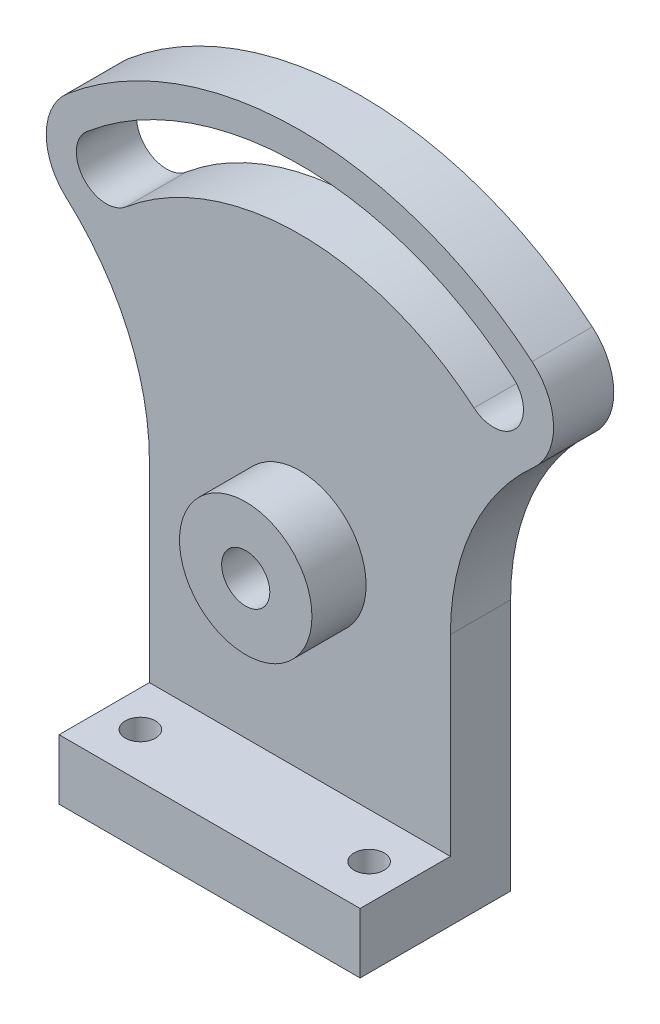
ISO-10303-21;
HEADER;
FILE_DESCRIPTION(('STEP AP214'),'2;1');
FILE_NAME('part.step','',(''),(''),'','','');
FILE_SCHEMA(('AUTOMOTIVE_DESIGN { 1 0 10303 214 1 1 1 1 }'));
ENDSEC;
DATA;
#1=APPLICATION_CONTEXT('core data for automotive mechanical design processes');
#2=APPLICATION_PROTOCOL_DEFINITION('international standard','automotive_design',2000,#1);
#3=PRODUCT_CONTEXT('',#1,'mechanical');
#4=PRODUCT('Part','Part','',(#3));
#5=PRODUCT_RELATED_PRODUCT_CATEGORY('part','',(#4));
#6=PRODUCT_DEFINITION_FORMATION('','',#4);
#7=PRODUCT_DEFINITION_CONTEXT('part definition',#1,'design');
#8=PRODUCT_DEFINITION('design','',#6,#7);
#9=PRODUCT_DEFINITION_SHAPE('','',#8);
#10=(LENGTH_UNIT() NAMED_UNIT(*) SI_UNIT(.MILLI.,.METRE.));
#11=(NAMED_UNIT(*) PLANE_ANGLE_UNIT() SI_UNIT($,.RADIAN.));
#12=(NAMED_UNIT(*) SI_UNIT($,.STERADIAN.) SOLID_ANGLE_UNIT());
#13=UNCERTAINTY_MEASURE_WITH_UNIT(LENGTH_MEASURE(1.E-05),#10,'distance_accuracy_value','');
#14=(GEOMETRIC_REPRESENTATION_CONTEXT(3) GLOBAL_UNCERTAINTY_ASSIGNED_CONTEXT((#13)) GLOBAL_UNIT_ASSIGNED_CONTEXT((#10,
#11,#12)) REPRESENTATION_CONTEXT('',''));
#15=CARTESIAN_POINT('',(0.,0.,0.));
#16=DIRECTION('',(0.,0.,1.));
#17=DIRECTION('',(1.,0.,0.));
#18=AXIS2_PLACEMENT_3D('',#15,#16,#17);
#19=CARTESIAN_POINT('',(-66.5842002615122,41.9032103569842,10.));
#20=DIRECTION('',(0.,0.,1.));
#21=DIRECTION('',(1.,0.,0.));
#22=AXIS2_PLACEMENT_3D('',#19,#20,#21);
#23=PLANE('',#22);
#24=CARTESIAN_POINT('',(0.,42.,10.));
#25=DIRECTION('',(0.,0.,-1.));
#26=DIRECTION('',(1.,0.,0.));
#27=AXIS2_PLACEMENT_3D('',#24,#25,#26);
#28=CIRCLE('',#27,45.);
#29=CARTESIAN_POINT('',(-28.9254424358943,76.471999940354,10.));
#30=VERTEX_POINT('',#29);
#31=CARTESIAN_POINT('',(28.9254424358943,76.471999940354,10.));
#32=VERTEX_POINT('',#31);
#33=EDGE_CURVE('E525',#30,#32,#28,.T.);
#34=ORIENTED_EDGE('',*,*,#33,.F.);
#35=CARTESIAN_POINT('',(-32.139380484327,80.3022221559489,10.));
#36=DIRECTION('',(0.,0.,1.));
#37=DIRECTION('',(-1.,0.,0.));
#38=AXIS2_PLACEMENT_3D('',#35,#36,#37);
#39=CIRCLE('',#38,5.00000000000001);
#40=CARTESIAN_POINT('',(-35.3533185327597,84.1324443715437,10.));
#41=VERTEX_POINT('',#40);
#42=EDGE_CURVE('E201',#41,#30,#39,.T.);
#43=ORIENTED_EDGE('',*,*,#42,.F.);
#44=CARTESIAN_POINT('',(0.,42.,10.));
#45=DIRECTION('',(0.,0.,1.));
#46=DIRECTION('',(1.,0.,0.));
#47=AXIS2_PLACEMENT_3D('',#44,#45,#46);
#48=CIRCLE('',#47,55.);
#49=CARTESIAN_POINT('',(35.3533185327597,84.1324443715437,10.));
#50=VERTEX_POINT('',#49);
#51=EDGE_CURVE('E194',#50,#41,#48,.T.);
#52=ORIENTED_EDGE('',*,*,#51,.F.);
#53=CARTESIAN_POINT('',(32.139380484327,80.3022221559489,10.));
#54=DIRECTION('',(0.,0.,1.));
#55=DIRECTION('',(1.,0.,0.));
#56=AXIS2_PLACEMENT_3D('',#53,#54,#55);
#57=CIRCLE('',#56,5.00000000000001);
#58=EDGE_CURVE('E524',#32,#50,#57,.T.);
#59=ORIENTED_EDGE('',*,*,#58,.F.);
#60=EDGE_LOOP('',(#34,#43,#52,#59));
#61=FACE_BOUND('',#60,.T.);
#62=DIRECTION('',(-1.,0.,0.));
#63=VECTOR('',#62,1.);
#64=CARTESIAN_POINT('',(-25.,10.,10.));
#65=LINE('',#64,#63);
#66=CARTESIAN_POINT('',(25.,10.,10.));
#67=VERTEX_POINT('',#66);
#68=CARTESIAN_POINT('',(-25.,10.,10.));
#69=VERTEX_POINT('',#68);
#70=EDGE_CURVE('E50',#67,#69,#65,.T.);
#71=ORIENTED_EDGE('',*,*,#70,.F.);
#72=DIRECTION('',(0.,1.,0.));
#73=VECTOR('',#72,1.);
#74=CARTESIAN_POINT('',(25.,0.,10.));
#75=LINE('',#74,#73);
#76=CARTESIAN_POINT('',(25.,41.9032103569842,10.));
#77=VERTEX_POINT('',#76);
#78=EDGE_CURVE('E172',#67,#77,#75,.T.);
#79=ORIENTED_EDGE('',*,*,#78,.T.);
#80=CARTESIAN_POINT('',(66.5842002615122,41.9032103569842,10.));
#81=DIRECTION('',(0.,0.,-1.));
#82=DIRECTION('',(-1.,0.,0.));
#83=AXIS2_PLACEMENT_3D('',#80,#81,#82);
#84=CIRCLE('',#83,41.5842002615121);
#85=CARTESIAN_POINT('',(38.8167777498779,72.8582738918881,10.));
#86=VERTEX_POINT('',#85);
#87=EDGE_CURVE('E256',#77,#86,#84,.T.);
#88=ORIENTED_EDGE('',*,*,#87,.T.);
#89=CARTESIAN_POINT('',(32.139380484327,80.3022221559489,10.));
#90=DIRECTION('',(0.,0.,1.));
#91=DIRECTION('',(1.,0.,0.));
#92=AXIS2_PLACEMENT_3D('',#89,#90,#91);
#93=CIRCLE('',#92,10.);
#94=CARTESIAN_POINT('',(38.5672565811924,87.9626665871386,10.));
#95=VERTEX_POINT('',#94);
#96=EDGE_CURVE('E255',#86,#95,#93,.T.);
#97=ORIENTED_EDGE('',*,*,#96,.T.);
#98=CARTESIAN_POINT('',(0.,42.,10.));
#99=DIRECTION('',(0.,0.,1.));
#100=DIRECTION('',(1.,0.,0.));
#101=AXIS2_PLACEMENT_3D('',#98,#99,#100);
#102=CIRCLE('',#101,60.);
#103=CARTESIAN_POINT('',(-38.5672565811924,87.9626665871386,10.));
#104=VERTEX_POINT('',#103);
#105=EDGE_CURVE('E253',#95,#104,#102,.T.);
#106=ORIENTED_EDGE('',*,*,#105,.T.);
#107=CARTESIAN_POINT('',(-32.139380484327,80.3022221559489,10.));
#108=DIRECTION('',(0.,0.,1.));
#109=DIRECTION('',(-1.,0.,0.));
#110=AXIS2_PLACEMENT_3D('',#107,#108,#109);
#111=CIRCLE('',#110,10.);
#112=CARTESIAN_POINT('',(-38.8167777498779,72.8582738918881,10.));
#113=VERTEX_POINT('',#112);
#114=EDGE_CURVE('E251',#104,#113,#111,.T.);
#115=ORIENTED_EDGE('',*,*,#114,.T.);
#116=CARTESIAN_POINT('',(-66.5842002615122,41.9032103569842,10.));
#117=DIRECTION('',(0.,0.,-1.));
#118=DIRECTION('',(1.,0.,0.));
#119=AXIS2_PLACEMENT_3D('',#116,#117,#118);
#120=CIRCLE('',#119,41.5842002615121);
#121=CARTESIAN_POINT('',(-25.,41.9032103569842,10.));
#122=VERTEX_POINT('',#121);
#123=EDGE_CURVE('E235',#113,#122,#120,.T.);
#124=ORIENTED_EDGE('',*,*,#123,.T.);
#125=DIRECTION('',(0.,-1.,0.));
#126=VECTOR('',#125,1.);
#127=CARTESIAN_POINT('',(-25.,0.,10.));
#128=LINE('',#127,#126);
#129=EDGE_CURVE('E214',#122,#69,#128,.T.);
#130=ORIENTED_EDGE('',*,*,#129,.T.);
#131=EDGE_LOOP('',(#71,#79,#88,#97,#106,#115,#124,#130));
#132=FACE_BOUND('',#131,.T.);
#133=CARTESIAN_POINT('',(0.,42.,10.));
#134=DIRECTION('',(0.,0.,1.));
#135=DIRECTION('',(1.,0.,0.));
#136=AXIS2_PLACEMENT_3D('',#133,#134,#135);
#137=CIRCLE('',#136,11.);
#138=CARTESIAN_POINT('',(11.,42.,10.));
#139=VERTEX_POINT('',#138);
#140=EDGE_CURVE('E348',#139,#139,#137,.T.);
#141=ORIENTED_EDGE('',*,*,#140,.F.);
#142=EDGE_LOOP('',(#141));
#143=FACE_BOUND('',#142,.T.);
#144=ADVANCED_FACE('F33',(#61,#132,#143),#23,.T.);
#145=CARTESIAN_POINT('',(-66.5842002615122,41.9032103569842,0.));
#146=DIRECTION('',(0.,0.,1.));
#147=DIRECTION('',(1.,0.,0.));
#148=AXIS2_PLACEMENT_3D('',#145,#146,#147);
#149=PLANE('',#148);
#150=DIRECTION('',(0.,-1.,0.));
#151=VECTOR('',#150,1.);
#152=CARTESIAN_POINT('',(-25.,0.,0.));
#153=LINE('',#152,#151);
#154=CARTESIAN_POINT('',(-25.,41.9032103569842,0.));
#155=VERTEX_POINT('',#154);
#156=CARTESIAN_POINT('',(-25.,0.,0.));
#157=VERTEX_POINT('',#156);
#158=EDGE_CURVE('E142',#155,#157,#153,.T.);
#159=ORIENTED_EDGE('',*,*,#158,.F.);
#160=CARTESIAN_POINT('',(-66.5842002615122,41.9032103569842,0.));
#161=DIRECTION('',(0.,0.,-1.));
#162=DIRECTION('',(1.,0.,0.));
#163=AXIS2_PLACEMENT_3D('',#160,#161,#162);
#164=CIRCLE('',#163,41.5842002615121);
#165=CARTESIAN_POINT('',(-38.8167777498779,72.8582738918881,0.));
#166=VERTEX_POINT('',#165);
#167=EDGE_CURVE('E215',#166,#155,#164,.T.);
#168=ORIENTED_EDGE('',*,*,#167,.F.);
#169=CARTESIAN_POINT('',(-32.139380484327,80.3022221559489,0.));
#170=DIRECTION('',(0.,0.,1.));
#171=DIRECTION('',(-1.,0.,0.));
#172=AXIS2_PLACEMENT_3D('',#169,#170,#171);
#173=CIRCLE('',#172,10.);
#174=CARTESIAN_POINT('',(-38.5672565811924,87.9626665871386,0.));
#175=VERTEX_POINT('',#174);
#176=EDGE_CURVE('E237',#175,#166,#173,.T.);
#177=ORIENTED_EDGE('',*,*,#176,.F.);
#178=CARTESIAN_POINT('',(0.,42.,0.));
#179=DIRECTION('',(0.,0.,1.));
#180=DIRECTION('',(1.,0.,0.));
#181=AXIS2_PLACEMENT_3D('',#178,#179,#180);
#182=CIRCLE('',#181,60.);
#183=CARTESIAN_POINT('',(38.5672565811924,87.9626665871386,0.));
#184=VERTEX_POINT('',#183);
#185=EDGE_CURVE('E239',#184,#175,#182,.T.);
#186=ORIENTED_EDGE('',*,*,#185,.F.);
#187=CARTESIAN_POINT('',(32.139380484327,80.3022221559489,0.));
#188=DIRECTION('',(0.,0.,1.));
#189=DIRECTION('',(1.,0.,0.));
#190=AXIS2_PLACEMENT_3D('',#187,#188,#189);
#191=CIRCLE('',#190,10.);
#192=CARTESIAN_POINT('',(38.8167777498779,72.8582738918881,0.));
#193=VERTEX_POINT('',#192);
#194=EDGE_CURVE('E241',#193,#184,#191,.T.);
#195=ORIENTED_EDGE('',*,*,#194,.F.);
#196=CARTESIAN_POINT('',(66.5842002615122,41.9032103569842,0.));
#197=DIRECTION('',(0.,0.,-1.));
#198=DIRECTION('',(-1.,0.,0.));
#199=AXIS2_PLACEMENT_3D('',#196,#197,#198);
#200=CIRCLE('',#199,41.5842002615121);
#201=CARTESIAN_POINT('',(25.,41.9032103569842,0.));
#202=VERTEX_POINT('',#201);
#203=EDGE_CURVE('E243',#202,#193,#200,.T.);
#204=ORIENTED_EDGE('',*,*,#203,.F.);
#205=DIRECTION('',(0.,1.,0.));
#206=VECTOR('',#205,1.);
#207=CARTESIAN_POINT('',(25.,0.,0.));
#208=LINE('',#207,#206);
#209=CARTESIAN_POINT('',(25.,0.,0.));
#210=VERTEX_POINT('',#209);
#211=EDGE_CURVE('E245',#210,#202,#208,.T.);
#212=ORIENTED_EDGE('',*,*,#211,.F.);
#213=DIRECTION('',(1.,0.,0.));
#214=VECTOR('',#213,1.);
#215=CARTESIAN_POINT('',(-25.,0.,0.));
#216=LINE('',#215,#214);
#217=EDGE_CURVE('E247',#157,#210,#216,.T.);
#218=ORIENTED_EDGE('',*,*,#217,.F.);
#219=EDGE_LOOP('',(#159,#168,#177,#186,#195,#204,#212,#218));
#220=FACE_BOUND('',#219,.T.);
#221=CARTESIAN_POINT('',(-32.139380484327,80.3022221559489,0.));
#222=DIRECTION('',(0.,0.,1.));
#223=DIRECTION('',(-1.,0.,0.));
#224=AXIS2_PLACEMENT_3D('',#221,#222,#223);
#225=CIRCLE('',#224,5.00000000000001);
#226=CARTESIAN_POINT('',(-35.3533185327597,84.1324443715437,0.));
#227=VERTEX_POINT('',#226);
#228=CARTESIAN_POINT('',(-28.9254424358943,76.471999940354,0.));
#229=VERTEX_POINT('',#228);
#230=EDGE_CURVE('E182',#227,#229,#225,.T.);
#231=ORIENTED_EDGE('',*,*,#230,.T.);
#232=CARTESIAN_POINT('',(0.,42.,0.));
#233=DIRECTION('',(0.,0.,-1.));
#234=DIRECTION('',(1.,0.,0.));
#235=AXIS2_PLACEMENT_3D('',#232,#233,#234);
#236=CIRCLE('',#235,45.);
#237=CARTESIAN_POINT('',(28.9254424358943,76.471999940354,0.));
#238=VERTEX_POINT('',#237);
#239=EDGE_CURVE('E186',#229,#238,#236,.T.);
#240=ORIENTED_EDGE('',*,*,#239,.T.);
#241=CARTESIAN_POINT('',(32.139380484327,80.3022221559489,0.));
#242=DIRECTION('',(0.,0.,1.));
#243=DIRECTION('',(1.,0.,0.));
#244=AXIS2_PLACEMENT_3D('',#241,#242,#243);
#245=CIRCLE('',#244,5.00000000000001);
#246=CARTESIAN_POINT('',(35.3533185327597,84.1324443715437,0.));
#247=VERTEX_POINT('',#246);
#248=EDGE_CURVE('E191',#238,#247,#245,.T.);
#249=ORIENTED_EDGE('',*,*,#248,.T.);
#250=CARTESIAN_POINT('',(0.,42.,0.));
#251=DIRECTION('',(0.,0.,1.));
#252=DIRECTION('',(1.,0.,0.));
#253=AXIS2_PLACEMENT_3D('',#250,#251,#252);
#254=CIRCLE('',#253,55.);
#255=EDGE_CURVE('E199',#247,#227,#254,.T.);
#256=ORIENTED_EDGE('',*,*,#255,.T.);
#257=EDGE_LOOP('',(#231,#240,#249,#256));
#258=FACE_BOUND('',#257,.T.);
#259=CARTESIAN_POINT('',(0.,42.,0.));
#260=DIRECTION('',(0.,0.,1.));
#261=DIRECTION('',(1.,0.,0.));
#262=AXIS2_PLACEMENT_3D('',#259,#260,#261);
#263=CIRCLE('',#262,4.);
#264=CARTESIAN_POINT('',(4.,42.,0.));
#265=VERTEX_POINT('',#264);
#266=EDGE_CURVE('E168',#265,#265,#263,.T.);
#267=ORIENTED_EDGE('',*,*,#266,.T.);
#268=EDGE_LOOP('',(#267));
#269=FACE_BOUND('',#268,.T.);
#270=ADVANCED_FACE('F305',(#220,#258,#269),#149,.F.);
#271=CARTESIAN_POINT('',(-25.,0.,10.));
#272=DIRECTION('',(1.,0.,0.));
#273=DIRECTION('',(0.,0.,-1.));
#274=AXIS2_PLACEMENT_3D('',#271,#272,#273);
#275=PLANE('',#274);
#276=ORIENTED_EDGE('',*,*,#158,.T.);
#277=DIRECTION('',(0.,0.,-1.));
#278=VECTOR('',#277,1.);
#279=CARTESIAN_POINT('',(-25.,0.,10.));
#280=LINE('',#279,#278);
#281=CARTESIAN_POINT('',(-25.,0.,25.));
#282=VERTEX_POINT('',#281);
#283=EDGE_CURVE('E11',#282,#157,#280,.T.);
#284=ORIENTED_EDGE('',*,*,#283,.F.);
#285=DIRECTION('',(0.,-1.,0.));
#286=VECTOR('',#285,1.);
#287=CARTESIAN_POINT('',(-25.,0.,25.));
#288=LINE('',#287,#286);
#289=CARTESIAN_POINT('',(-25.,10.,25.));
#290=VERTEX_POINT('',#289);
#291=EDGE_CURVE('E139',#290,#282,#288,.T.);
#292=ORIENTED_EDGE('',*,*,#291,.F.);
#293=DIRECTION('',(0.,0.,-1.));
#294=VECTOR('',#293,1.);
#295=CARTESIAN_POINT('',(-25.,10.,25.));
#296=LINE('',#295,#294);
#297=EDGE_CURVE('E165',#290,#69,#296,.T.);
#298=ORIENTED_EDGE('',*,*,#297,.T.);
#299=ORIENTED_EDGE('',*,*,#129,.F.);
#300=DIRECTION('',(0.,0.,-1.));
#301=VECTOR('',#300,1.);
#302=CARTESIAN_POINT('',(-25.,41.9032103569842,10.));
#303=LINE('',#302,#301);
#304=EDGE_CURVE('E233',#122,#155,#303,.T.);
#305=ORIENTED_EDGE('',*,*,#304,.T.);
#306=EDGE_LOOP('',(#276,#284,#292,#298,#299,#305));
#307=FACE_BOUND('',#306,.T.);
#308=ADVANCED_FACE('F35',(#307),#275,.F.);
#309=CARTESIAN_POINT('',(-25.,0.,10.));
#310=DIRECTION('',(0.,1.,0.));
#311=DIRECTION('',(0.,0.,1.));
#312=AXIS2_PLACEMENT_3D('',#309,#310,#311);
#313=PLANE('',#312);
#314=CARTESIAN_POINT('',(19.,0.,17.5));
#315=DIRECTION('',(0.,1.,0.));
#316=DIRECTION('',(0.,0.,1.));
#317=AXIS2_PLACEMENT_3D('',#314,#315,#316);
#318=CIRCLE('',#317,2.5);
#319=CARTESIAN_POINT('',(19.,0.,20.));
#320=VERTEX_POINT('',#319);
#321=EDGE_CURVE('E337',#320,#320,#318,.T.);
#322=ORIENTED_EDGE('',*,*,#321,.T.);
#323=EDGE_LOOP('',(#322));
#324=FACE_BOUND('',#323,.T.);
#325=CARTESIAN_POINT('',(-19.,0.,17.5));
#326=DIRECTION('',(0.,1.,0.));
#327=DIRECTION('',(0.,0.,1.));
#328=AXIS2_PLACEMENT_3D('',#325,#326,#327);
#329=CIRCLE('',#328,2.5);
#330=CARTESIAN_POINT('',(-19.,0.,20.));
#331=VERTEX_POINT('',#330);
#332=EDGE_CURVE('E157',#331,#331,#329,.T.);
#333=ORIENTED_EDGE('',*,*,#332,.T.);
#334=EDGE_LOOP('',(#333));
#335=FACE_BOUND('',#334,.T.);
#336=ORIENTED_EDGE('',*,*,#217,.T.);
#337=DIRECTION('',(0.,0.,-1.));
#338=VECTOR('',#337,1.);
#339=CARTESIAN_POINT('',(25.,0.,10.));
#340=LINE('',#339,#338);
#341=CARTESIAN_POINT('',(25.,0.,25.));
#342=VERTEX_POINT('',#341);
#343=EDGE_CURVE('E42',#342,#210,#340,.T.);
#344=ORIENTED_EDGE('',*,*,#343,.F.);
#345=DIRECTION('',(1.,0.,0.));
#346=VECTOR('',#345,1.);
#347=CARTESIAN_POINT('',(-25.,0.,25.));
#348=LINE('',#347,#346);
#349=EDGE_CURVE('E145',#282,#342,#348,.T.);
#350=ORIENTED_EDGE('',*,*,#349,.F.);
#351=ORIENTED_EDGE('',*,*,#283,.T.);
#352=EDGE_LOOP('',(#336,#344,#350,#351));
#353=FACE_BOUND('',#352,.T.);
#354=ADVANCED_FACE('F146',(#324,#335,#353),#313,.F.);
#355=CARTESIAN_POINT('',(25.,0.,10.));
#356=DIRECTION('',(-1.,0.,0.));
#357=DIRECTION('',(0.,0.,1.));
#358=AXIS2_PLACEMENT_3D('',#355,#356,#357);
#359=PLANE('',#358);
#360=ORIENTED_EDGE('',*,*,#211,.T.);
#361=DIRECTION('',(0.,0.,-1.));
#362=VECTOR('',#361,1.);
#363=CARTESIAN_POINT('',(25.,41.9032103569842,10.));
#364=LINE('',#363,#362);
#365=EDGE_CURVE('E218',#77,#202,#364,.T.);
#366=ORIENTED_EDGE('',*,*,#365,.F.);
#367=ORIENTED_EDGE('',*,*,#78,.F.);
#368=DIRECTION('',(0.,0.,-1.));
#369=VECTOR('',#368,1.);
#370=CARTESIAN_POINT('',(25.,10.,25.));
#371=LINE('',#370,#369);
#372=CARTESIAN_POINT('',(25.,10.,25.));
#373=VERTEX_POINT('',#372);
#374=EDGE_CURVE('E176',#373,#67,#371,.T.);
#375=ORIENTED_EDGE('',*,*,#374,.F.);
#376=DIRECTION('',(0.,1.,0.));
#377=VECTOR('',#376,1.);
#378=CARTESIAN_POINT('',(25.,0.,25.));
#379=LINE('',#378,#377);
#380=EDGE_CURVE('E150',#342,#373,#379,.T.);
#381=ORIENTED_EDGE('',*,*,#380,.F.);
#382=ORIENTED_EDGE('',*,*,#343,.T.);
#383=EDGE_LOOP('',(#360,#366,#367,#375,#381,#382));
#384=FACE_BOUND('',#383,.T.);
#385=ADVANCED_FACE('F262',(#384),#359,.F.);
#386=CARTESIAN_POINT('',(66.5842002615122,41.9032103569842,10.));
#387=DIRECTION('',(0.,0.,-1.));
#388=DIRECTION('',(-1.,0.,0.));
#389=AXIS2_PLACEMENT_3D('',#386,#387,#388);
#390=CYLINDRICAL_SURFACE('',#389,41.5842002615121);
#391=ORIENTED_EDGE('',*,*,#203,.T.);
#392=DIRECTION('',(0.,0.,-1.));
#393=VECTOR('',#392,1.);
#394=CARTESIAN_POINT('',(38.8167777498779,72.8582738918881,10.));
#395=LINE('',#394,#393);
#396=EDGE_CURVE('E221',#86,#193,#395,.T.);
#397=ORIENTED_EDGE('',*,*,#396,.F.);
#398=ORIENTED_EDGE('',*,*,#87,.F.);
#399=ORIENTED_EDGE('',*,*,#365,.T.);
#400=EDGE_LOOP('',(#391,#397,#398,#399));
#401=FACE_BOUND('',#400,.T.);
#402=ADVANCED_FACE('F266',(#401),#390,.F.);
#403=CARTESIAN_POINT('',(32.139380484327,80.3022221559489,10.));
#404=DIRECTION('',(0.,0.,-1.));
#405=DIRECTION('',(-1.,0.,0.));
#406=AXIS2_PLACEMENT_3D('',#403,#404,#405);
#407=CYLINDRICAL_SURFACE('',#406,10.);
#408=ORIENTED_EDGE('',*,*,#194,.T.);
#409=DIRECTION('',(0.,0.,-1.));
#410=VECTOR('',#409,1.);
#411=CARTESIAN_POINT('',(38.5672565811924,87.9626665871386,10.));
#412=LINE('',#411,#410);
#413=EDGE_CURVE('E224',#95,#184,#412,.T.);
#414=ORIENTED_EDGE('',*,*,#413,.F.);
#415=ORIENTED_EDGE('',*,*,#96,.F.);
#416=ORIENTED_EDGE('',*,*,#396,.T.);
#417=EDGE_LOOP('',(#408,#414,#415,#416));
#418=FACE_BOUND('',#417,.T.);
#419=ADVANCED_FACE('F271',(#418),#407,.T.);
#420=CARTESIAN_POINT('',(0.,42.,10.));
#421=DIRECTION('',(0.,0.,-1.));
#422=DIRECTION('',(-1.,0.,0.));
#423=AXIS2_PLACEMENT_3D('',#420,#421,#422);
#424=CYLINDRICAL_SURFACE('',#423,60.);
#425=ORIENTED_EDGE('',*,*,#185,.T.);
#426=DIRECTION('',(0.,0.,-1.));
#427=VECTOR('',#426,1.);
#428=CARTESIAN_POINT('',(-38.5672565811924,87.9626665871386,10.));
#429=LINE('',#428,#427);
#430=EDGE_CURVE('E227',#104,#175,#429,.T.);
#431=ORIENTED_EDGE('',*,*,#430,.F.);
#432=ORIENTED_EDGE('',*,*,#105,.F.);
#433=ORIENTED_EDGE('',*,*,#413,.T.);
#434=EDGE_LOOP('',(#425,#431,#432,#433));
#435=FACE_BOUND('',#434,.T.);
#436=ADVANCED_FACE('F277',(#435),#424,.T.);
#437=CARTESIAN_POINT('',(-32.139380484327,80.3022221559489,10.));
#438=DIRECTION('',(0.,0.,-1.));
#439=DIRECTION('',(-1.,0.,0.));
#440=AXIS2_PLACEMENT_3D('',#437,#438,#439);
#441=CYLINDRICAL_SURFACE('',#440,10.);
#442=ORIENTED_EDGE('',*,*,#176,.T.);
#443=DIRECTION('',(0.,0.,-1.));
#444=VECTOR('',#443,1.);
#445=CARTESIAN_POINT('',(-38.8167777498779,72.8582738918881,10.));
#446=LINE('',#445,#444);
#447=EDGE_CURVE('E230',#113,#166,#446,.T.);
#448=ORIENTED_EDGE('',*,*,#447,.F.);
#449=ORIENTED_EDGE('',*,*,#114,.F.);
#450=ORIENTED_EDGE('',*,*,#430,.T.);
#451=EDGE_LOOP('',(#442,#448,#449,#450));
#452=FACE_BOUND('',#451,.T.);
#453=ADVANCED_FACE('F281',(#452),#441,.T.);
#454=CARTESIAN_POINT('',(-66.5842002615122,41.9032103569842,10.));
#455=DIRECTION('',(0.,0.,-1.));
#456=DIRECTION('',(-1.,0.,0.));
#457=AXIS2_PLACEMENT_3D('',#454,#455,#456);
#458=CYLINDRICAL_SURFACE('',#457,41.5842002615121);
#459=ORIENTED_EDGE('',*,*,#167,.T.);
#460=ORIENTED_EDGE('',*,*,#304,.F.);
#461=ORIENTED_EDGE('',*,*,#123,.F.);
#462=ORIENTED_EDGE('',*,*,#447,.T.);
#463=EDGE_LOOP('',(#459,#460,#461,#462));
#464=FACE_BOUND('',#463,.T.);
#465=ADVANCED_FACE('F286',(#464),#458,.F.);
#466=CARTESIAN_POINT('',(-32.139380484327,80.3022221559489,10.));
#467=DIRECTION('',(0.,0.,-1.));
#468=DIRECTION('',(-1.,0.,0.));
#469=AXIS2_PLACEMENT_3D('',#466,#467,#468);
#470=CYLINDRICAL_SURFACE('',#469,5.00000000000001);
#471=ORIENTED_EDGE('',*,*,#230,.F.);
#472=DIRECTION('',(0.,0.,-1.));
#473=VECTOR('',#472,1.);
#474=CARTESIAN_POINT('',(-35.3533185327597,84.1324443715437,10.));
#475=LINE('',#474,#473);
#476=EDGE_CURVE('E202',#41,#227,#475,.T.);
#477=ORIENTED_EDGE('',*,*,#476,.F.);
#478=ORIENTED_EDGE('',*,*,#42,.T.);
#479=DIRECTION('',(0.,0.,-1.));
#480=VECTOR('',#479,1.);
#481=CARTESIAN_POINT('',(-28.9254424358943,76.471999940354,10.));
#482=LINE('',#481,#480);
#483=EDGE_CURVE('E208',#30,#229,#482,.T.);
#484=ORIENTED_EDGE('',*,*,#483,.T.);
#485=EDGE_LOOP('',(#471,#477,#478,#484));
#486=FACE_BOUND('',#485,.T.);
#487=ADVANCED_FACE('F315',(#486),#470,.F.);
#488=CARTESIAN_POINT('',(0.,42.,10.));
#489=DIRECTION('',(0.,0.,-1.));
#490=DIRECTION('',(-1.,0.,0.));
#491=AXIS2_PLACEMENT_3D('',#488,#489,#490);
#492=CYLINDRICAL_SURFACE('',#491,45.);
#493=ORIENTED_EDGE('',*,*,#239,.F.);
#494=ORIENTED_EDGE('',*,*,#483,.F.);
#495=ORIENTED_EDGE('',*,*,#33,.T.);
#496=DIRECTION('',(0.,0.,-1.));
#497=VECTOR('',#496,1.);
#498=CARTESIAN_POINT('',(28.9254424358943,76.471999940354,10.));
#499=LINE('',#498,#497);
#500=EDGE_CURVE('E206',#32,#238,#499,.T.);
#501=ORIENTED_EDGE('',*,*,#500,.T.);
#502=EDGE_LOOP('',(#493,#494,#495,#501));
#503=FACE_BOUND('',#502,.T.);
#504=ADVANCED_FACE('F421',(#503),#492,.T.);
#505=CARTESIAN_POINT('',(32.139380484327,80.3022221559489,10.));
#506=DIRECTION('',(0.,0.,-1.));
#507=DIRECTION('',(-1.,0.,0.));
#508=AXIS2_PLACEMENT_3D('',#505,#506,#507);
#509=CYLINDRICAL_SURFACE('',#508,5.00000000000001);
#510=ORIENTED_EDGE('',*,*,#248,.F.);
#511=ORIENTED_EDGE('',*,*,#500,.F.);
#512=ORIENTED_EDGE('',*,*,#58,.T.);
#513=DIRECTION('',(0.,0.,-1.));
#514=VECTOR('',#513,1.);
#515=CARTESIAN_POINT('',(35.3533185327597,84.1324443715437,10.));
#516=LINE('',#515,#514);
#517=EDGE_CURVE('E58',#50,#247,#516,.T.);
#518=ORIENTED_EDGE('',*,*,#517,.T.);
#519=EDGE_LOOP('',(#510,#511,#512,#518));
#520=FACE_BOUND('',#519,.T.);
#521=ADVANCED_FACE('F413',(#520),#509,.F.);
#522=CARTESIAN_POINT('',(0.,42.,10.));
#523=DIRECTION('',(0.,0.,-1.));
#524=DIRECTION('',(-1.,0.,0.));
#525=AXIS2_PLACEMENT_3D('',#522,#523,#524);
#526=CYLINDRICAL_SURFACE('',#525,55.);
#527=ORIENTED_EDGE('',*,*,#255,.F.);
#528=ORIENTED_EDGE('',*,*,#517,.F.);
#529=ORIENTED_EDGE('',*,*,#51,.T.);
#530=ORIENTED_EDGE('',*,*,#476,.T.);
#531=EDGE_LOOP('',(#527,#528,#529,#530));
#532=FACE_BOUND('',#531,.T.);
#533=ADVANCED_FACE('F299',(#532),#526,.F.);
#534=CARTESIAN_POINT('',(0.,42.,10.));
#535=DIRECTION('',(0.,0.,-1.));
#536=DIRECTION('',(-1.,0.,0.));
#537=AXIS2_PLACEMENT_3D('',#534,#535,#536);
#538=CYLINDRICAL_SURFACE('',#537,4.);
#539=ORIENTED_EDGE('',*,*,#266,.F.);
#540=EDGE_LOOP('',(#539));
#541=FACE_BOUND('',#540,.T.);
#542=CARTESIAN_POINT('',(0.,42.,19.));
#543=DIRECTION('',(0.,0.,1.));
#544=DIRECTION('',(1.,0.,0.));
#545=AXIS2_PLACEMENT_3D('',#542,#543,#544);
#546=CIRCLE('',#545,4.00000000000001);
#547=CARTESIAN_POINT('',(4.00000000000001,42.,19.));
#548=VERTEX_POINT('',#547);
#549=EDGE_CURVE('E351',#548,#548,#546,.T.);
#550=ORIENTED_EDGE('',*,*,#549,.T.);
#551=EDGE_LOOP('',(#550));
#552=FACE_BOUND('',#551,.T.);
#553=ADVANCED_FACE('F290',(#541,#552),#538,.F.);
#554=CARTESIAN_POINT('',(-25.,10.,25.));
#555=DIRECTION('',(0.,-1.,0.));
#556=DIRECTION('',(0.,0.,-1.));
#557=AXIS2_PLACEMENT_3D('',#554,#555,#556);
#558=PLANE('',#557);
#559=CARTESIAN_POINT('',(19.,10.,17.5));
#560=DIRECTION('',(0.,1.,0.));
#561=DIRECTION('',(0.,0.,1.));
#562=AXIS2_PLACEMENT_3D('',#559,#560,#561);
#563=CIRCLE('',#562,2.5);
#564=CARTESIAN_POINT('',(19.,10.,20.));
#565=VERTEX_POINT('',#564);
#566=EDGE_CURVE('E343',#565,#565,#563,.T.);
#567=ORIENTED_EDGE('',*,*,#566,.F.);
#568=EDGE_LOOP('',(#567));
#569=FACE_BOUND('',#568,.T.);
#570=CARTESIAN_POINT('',(-19.,10.,17.5));
#571=DIRECTION('',(0.,1.,0.));
#572=DIRECTION('',(0.,0.,1.));
#573=AXIS2_PLACEMENT_3D('',#570,#571,#572);
#574=CIRCLE('',#573,2.5);
#575=CARTESIAN_POINT('',(-19.,10.,20.));
#576=VERTEX_POINT('',#575);
#577=EDGE_CURVE('E160',#576,#576,#574,.T.);
#578=ORIENTED_EDGE('',*,*,#577,.F.);
#579=EDGE_LOOP('',(#578));
#580=FACE_BOUND('',#579,.T.);
#581=ORIENTED_EDGE('',*,*,#70,.T.);
#582=ORIENTED_EDGE('',*,*,#297,.F.);
#583=DIRECTION('',(-1.,0.,0.));
#584=VECTOR('',#583,1.);
#585=CARTESIAN_POINT('',(-25.,10.,25.));
#586=LINE('',#585,#584);
#587=EDGE_CURVE('E154',#373,#290,#586,.T.);
#588=ORIENTED_EDGE('',*,*,#587,.F.);
#589=ORIENTED_EDGE('',*,*,#374,.T.);
#590=EDGE_LOOP('',(#581,#582,#588,#589));
#591=FACE_BOUND('',#590,.T.);
#592=ADVANCED_FACE('F288',(#569,#580,#591),#558,.F.);
#593=CARTESIAN_POINT('',(0.,0.,25.));
#594=DIRECTION('',(0.,0.,-1.));
#595=DIRECTION('',(-1.,0.,0.));
#596=AXIS2_PLACEMENT_3D('',#593,#594,#595);
#597=PLANE('',#596);
#598=ORIENTED_EDGE('',*,*,#291,.T.);
#599=ORIENTED_EDGE('',*,*,#349,.T.);
#600=ORIENTED_EDGE('',*,*,#380,.T.);
#601=ORIENTED_EDGE('',*,*,#587,.T.);
#602=EDGE_LOOP('',(#598,#599,#600,#601));
#603=FACE_BOUND('',#602,.T.);
#604=ADVANCED_FACE('F152',(#603),#597,.F.);
#605=CARTESIAN_POINT('',(-19.,0.,17.5));
#606=DIRECTION('',(0.,1.,0.));
#607=DIRECTION('',(0.,0.,1.));
#608=AXIS2_PLACEMENT_3D('',#605,#606,#607);
#609=CYLINDRICAL_SURFACE('',#608,2.5);
#610=ORIENTED_EDGE('',*,*,#332,.F.);
#611=EDGE_LOOP('',(#610));
#612=FACE_BOUND('',#611,.T.);
#613=ORIENTED_EDGE('',*,*,#577,.T.);
#614=EDGE_LOOP('',(#613));
#615=FACE_BOUND('',#614,.T.);
#616=ADVANCED_FACE('F297',(#612,#615),#609,.F.);
#617=CARTESIAN_POINT('',(19.,0.,17.5));
#618=DIRECTION('',(0.,1.,0.));
#619=DIRECTION('',(0.,0.,1.));
#620=AXIS2_PLACEMENT_3D('',#617,#618,#619);
#621=CYLINDRICAL_SURFACE('',#620,2.5);
#622=ORIENTED_EDGE('',*,*,#321,.F.);
#623=EDGE_LOOP('',(#622));
#624=FACE_BOUND('',#623,.T.);
#625=ORIENTED_EDGE('',*,*,#566,.T.);
#626=EDGE_LOOP('',(#625));
#627=FACE_BOUND('',#626,.T.);
#628=ADVANCED_FACE('F361',(#624,#627),#621,.F.);
#629=CARTESIAN_POINT('',(0.,42.,19.));
#630=DIRECTION('',(0.,0.,1.));
#631=DIRECTION('',(1.,0.,0.));
#632=AXIS2_PLACEMENT_3D('',#629,#630,#631);
#633=PLANE('',#632);
#634=CARTESIAN_POINT('',(0.,42.,19.));
#635=DIRECTION('',(0.,0.,1.));
#636=DIRECTION('',(1.,0.,0.));
#637=AXIS2_PLACEMENT_3D('',#634,#635,#636);
#638=CIRCLE('',#637,11.);
#639=CARTESIAN_POINT('',(11.,42.,19.));
#640=VERTEX_POINT('',#639);
#641=EDGE_CURVE('E346',#640,#640,#638,.T.);
#642=ORIENTED_EDGE('',*,*,#641,.T.);
#643=EDGE_LOOP('',(#642));
#644=FACE_BOUND('',#643,.T.);
#645=ORIENTED_EDGE('',*,*,#549,.F.);
#646=EDGE_LOOP('',(#645));
#647=FACE_BOUND('',#646,.T.);
#648=ADVANCED_FACE('F358',(#644,#647),#633,.T.);
#649=CARTESIAN_POINT('',(0.,42.,19.));
#650=DIRECTION('',(0.,0.,-1.));
#651=DIRECTION('',(-1.,0.,0.));
#652=AXIS2_PLACEMENT_3D('',#649,#650,#651);
#653=CYLINDRICAL_SURFACE('',#652,11.);
#654=ORIENTED_EDGE('',*,*,#641,.F.);
#655=EDGE_LOOP('',(#654));
#656=FACE_BOUND('',#655,.T.);
#657=ORIENTED_EDGE('',*,*,#140,.T.);
#658=EDGE_LOOP('',(#657));
#659=FACE_BOUND('',#658,.T.);
#660=ADVANCED_FACE('F360',(#656,#659),#653,.T.);
#661=CLOSED_SHELL('',(#144,#270,#308,#354,#385,#402,#419,#436,#453,#465,#487,#504,#521,#533,
#553,#592,#604,#616,#628,#648,#660));
#662=MANIFOLD_SOLID_BREP('B2',#661);
#663=ADVANCED_BREP_SHAPE_REPRESENTATION('',(#18,#662),#14);
#664=SHAPE_DEFINITION_REPRESENTATION(#9,#663);
ENDSEC;
END-ISO-10303-21;
